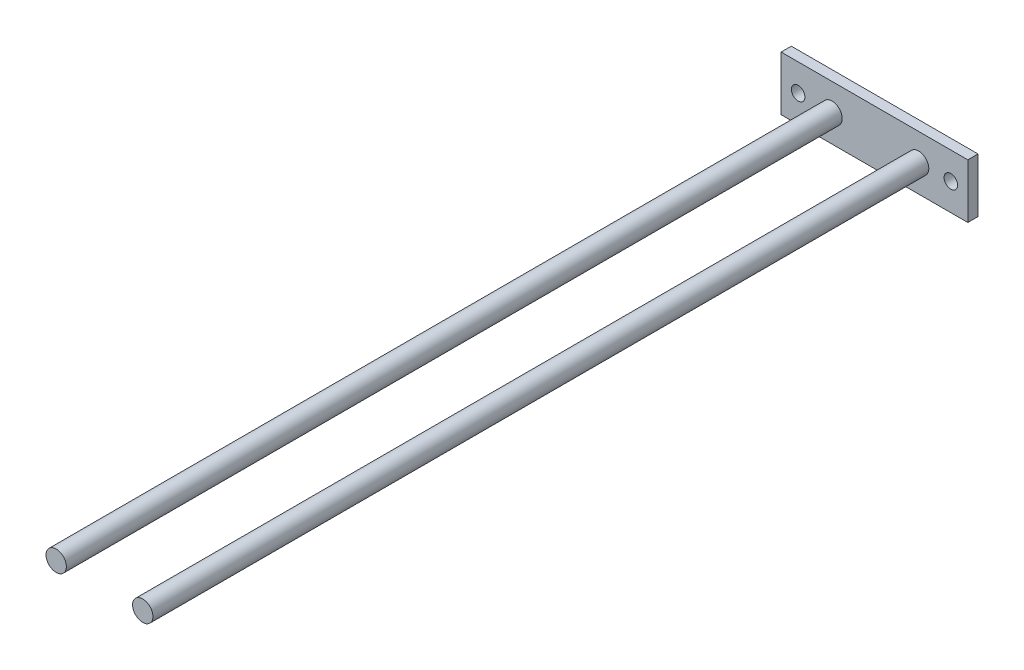
ISO-10303-21;
HEADER;
FILE_DESCRIPTION(('STEP AP214'),'2;1');
FILE_NAME('part.step','',(''),(''),'','','');
FILE_SCHEMA(('AUTOMOTIVE_DESIGN { 1 0 10303 214 1 1 1 1 }'));
ENDSEC;
DATA;
#1=APPLICATION_CONTEXT('core data for automotive mechanical design processes');
#2=APPLICATION_PROTOCOL_DEFINITION('international standard','automotive_design',2000,#1);
#3=PRODUCT_CONTEXT('',#1,'mechanical');
#4=PRODUCT('Part','Part','',(#3));
#5=PRODUCT_RELATED_PRODUCT_CATEGORY('part','',(#4));
#6=PRODUCT_DEFINITION_FORMATION('','',#4);
#7=PRODUCT_DEFINITION_CONTEXT('part definition',#1,'design');
#8=PRODUCT_DEFINITION('design','',#6,#7);
#9=PRODUCT_DEFINITION_SHAPE('','',#8);
#10=(LENGTH_UNIT() NAMED_UNIT(*) SI_UNIT(.MILLI.,.METRE.));
#11=(NAMED_UNIT(*) PLANE_ANGLE_UNIT() SI_UNIT($,.RADIAN.));
#12=(NAMED_UNIT(*) SI_UNIT($,.STERADIAN.) SOLID_ANGLE_UNIT());
#13=UNCERTAINTY_MEASURE_WITH_UNIT(LENGTH_MEASURE(1.E-05),#10,'distance_accuracy_value','');
#14=(GEOMETRIC_REPRESENTATION_CONTEXT(3) GLOBAL_UNCERTAINTY_ASSIGNED_CONTEXT((#13)) GLOBAL_UNIT_ASSIGNED_CONTEXT((#10,
#11,#12)) REPRESENTATION_CONTEXT('',''));
#15=CARTESIAN_POINT('',(0.,0.,0.));
#16=DIRECTION('',(0.,0.,1.));
#17=DIRECTION('',(1.,0.,0.));
#18=AXIS2_PLACEMENT_3D('',#15,#16,#17);
#19=CARTESIAN_POINT('',(0.,0.,3.));
#20=DIRECTION('',(0.,0.,-1.));
#21=DIRECTION('',(-1.,0.,0.));
#22=AXIS2_PLACEMENT_3D('',#19,#20,#21);
#23=PLANE('',#22);
#24=CARTESIAN_POINT('',(13.,0.,3.));
#25=DIRECTION('',(0.,0.,-1.));
#26=DIRECTION('',(-1.,0.,0.));
#27=AXIS2_PLACEMENT_3D('',#24,#25,#26);
#28=CIRCLE('',#27,3.);
#29=CARTESIAN_POINT('',(10.,0.,3.));
#30=VERTEX_POINT('',#29);
#31=EDGE_CURVE('E12',#30,#30,#28,.F.);
#32=ORIENTED_EDGE('',*,*,#31,.F.);
#33=EDGE_LOOP('',(#32));
#34=FACE_BOUND('',#33,.T.);
#35=CARTESIAN_POINT('',(-12.5,0.,3.));
#36=DIRECTION('',(0.,0.,-1.));
#37=DIRECTION('',(-1.,0.,0.));
#38=AXIS2_PLACEMENT_3D('',#35,#36,#37);
#39=CIRCLE('',#38,3.);
#40=CARTESIAN_POINT('',(-15.5,0.,3.));
#41=VERTEX_POINT('',#40);
#42=EDGE_CURVE('E79',#41,#41,#39,.F.);
#43=ORIENTED_EDGE('',*,*,#42,.F.);
#44=EDGE_LOOP('',(#43));
#45=FACE_BOUND('',#44,.T.);
#46=DIRECTION('',(-1.,0.,0.));
#47=VECTOR('',#46,1.);
#48=CARTESIAN_POINT('',(27.5,8.,3.));
#49=LINE('',#48,#47);
#50=CARTESIAN_POINT('',(27.5,8.,3.));
#51=VERTEX_POINT('',#50);
#52=CARTESIAN_POINT('',(-27.5,7.99999999999999,3.));
#53=VERTEX_POINT('',#52);
#54=EDGE_CURVE('E111',#51,#53,#49,.T.);
#55=ORIENTED_EDGE('',*,*,#54,.T.);
#56=DIRECTION('',(0.,1.,0.));
#57=VECTOR('',#56,1.);
#58=CARTESIAN_POINT('',(-27.5,-8.00000000000001,3.));
#59=LINE('',#58,#57);
#60=CARTESIAN_POINT('',(-27.5,-8.00000000000001,3.));
#61=VERTEX_POINT('',#60);
#62=EDGE_CURVE('E119',#61,#53,#59,.T.);
#63=ORIENTED_EDGE('',*,*,#62,.F.);
#64=DIRECTION('',(-1.,0.,0.));
#65=VECTOR('',#64,1.);
#66=CARTESIAN_POINT('',(27.5,-8.,3.));
#67=LINE('',#66,#65);
#68=CARTESIAN_POINT('',(27.5,-8.,3.));
#69=VERTEX_POINT('',#68);
#70=EDGE_CURVE('E130',#69,#61,#67,.T.);
#71=ORIENTED_EDGE('',*,*,#70,.F.);
#72=DIRECTION('',(0.,1.,0.));
#73=VECTOR('',#72,1.);
#74=CARTESIAN_POINT('',(27.5,-8.,3.));
#75=LINE('',#74,#73);
#76=EDGE_CURVE('E87',#69,#51,#75,.T.);
#77=ORIENTED_EDGE('',*,*,#76,.T.);
#78=EDGE_LOOP('',(#55,#63,#71,#77));
#79=FACE_BOUND('',#78,.T.);
#80=CARTESIAN_POINT('',(22.5,0.,3.));
#81=DIRECTION('',(0.,0.,1.));
#82=DIRECTION('',(1.,0.,0.));
#83=AXIS2_PLACEMENT_3D('',#80,#81,#82);
#84=CIRCLE('',#83,2.);
#85=CARTESIAN_POINT('',(24.5,0.,3.));
#86=VERTEX_POINT('',#85);
#87=EDGE_CURVE('E145',#86,#86,#84,.T.);
#88=ORIENTED_EDGE('',*,*,#87,.F.);
#89=EDGE_LOOP('',(#88));
#90=FACE_BOUND('',#89,.T.);
#91=CARTESIAN_POINT('',(-22.5,0.,3.));
#92=DIRECTION('',(0.,0.,1.));
#93=DIRECTION('',(1.,0.,0.));
#94=AXIS2_PLACEMENT_3D('',#91,#92,#93);
#95=CIRCLE('',#94,2.);
#96=CARTESIAN_POINT('',(-20.5,0.,3.));
#97=VERTEX_POINT('',#96);
#98=EDGE_CURVE('E197',#97,#97,#95,.T.);
#99=ORIENTED_EDGE('',*,*,#98,.F.);
#100=EDGE_LOOP('',(#99));
#101=FACE_BOUND('',#100,.T.);
#102=ADVANCED_FACE('F69',(#34,#45,#79,#90,#101),#23,.F.);
#103=CARTESIAN_POINT('',(0.,0.,0.));
#104=DIRECTION('',(0.,0.,-1.));
#105=DIRECTION('',(-1.,0.,0.));
#106=AXIS2_PLACEMENT_3D('',#103,#104,#105);
#107=PLANE('',#106);
#108=CARTESIAN_POINT('',(22.5,0.,0.));
#109=DIRECTION('',(0.,0.,1.));
#110=DIRECTION('',(1.,0.,0.));
#111=AXIS2_PLACEMENT_3D('',#108,#109,#110);
#112=CIRCLE('',#111,2.);
#113=CARTESIAN_POINT('',(24.5,0.,0.));
#114=VERTEX_POINT('',#113);
#115=EDGE_CURVE('E203',#114,#114,#112,.T.);
#116=ORIENTED_EDGE('',*,*,#115,.T.);
#117=EDGE_LOOP('',(#116));
#118=FACE_BOUND('',#117,.T.);
#119=DIRECTION('',(-1.,0.,0.));
#120=VECTOR('',#119,1.);
#121=CARTESIAN_POINT('',(27.5,8.,0.));
#122=LINE('',#121,#120);
#123=CARTESIAN_POINT('',(27.5,8.,0.));
#124=VERTEX_POINT('',#123);
#125=CARTESIAN_POINT('',(-27.5,7.99999999999999,0.));
#126=VERTEX_POINT('',#125);
#127=EDGE_CURVE('E141',#124,#126,#122,.T.);
#128=ORIENTED_EDGE('',*,*,#127,.F.);
#129=DIRECTION('',(0.,1.,0.));
#130=VECTOR('',#129,1.);
#131=CARTESIAN_POINT('',(27.5,-8.,0.));
#132=LINE('',#131,#130);
#133=CARTESIAN_POINT('',(27.5,-8.,0.));
#134=VERTEX_POINT('',#133);
#135=EDGE_CURVE('E106',#134,#124,#132,.T.);
#136=ORIENTED_EDGE('',*,*,#135,.F.);
#137=DIRECTION('',(-1.,0.,0.));
#138=VECTOR('',#137,1.);
#139=CARTESIAN_POINT('',(27.5,-8.,0.));
#140=LINE('',#139,#138);
#141=CARTESIAN_POINT('',(-27.5,-8.00000000000001,0.));
#142=VERTEX_POINT('',#141);
#143=EDGE_CURVE('E148',#134,#142,#140,.T.);
#144=ORIENTED_EDGE('',*,*,#143,.T.);
#145=DIRECTION('',(0.,1.,0.));
#146=VECTOR('',#145,1.);
#147=CARTESIAN_POINT('',(-27.5,-8.00000000000001,0.));
#148=LINE('',#147,#146);
#149=EDGE_CURVE('E121',#142,#126,#148,.T.);
#150=ORIENTED_EDGE('',*,*,#149,.T.);
#151=EDGE_LOOP('',(#128,#136,#144,#150));
#152=FACE_BOUND('',#151,.T.);
#153=CARTESIAN_POINT('',(-22.5,0.,0.));
#154=DIRECTION('',(0.,0.,1.));
#155=DIRECTION('',(1.,0.,0.));
#156=AXIS2_PLACEMENT_3D('',#153,#154,#155);
#157=CIRCLE('',#156,2.);
#158=CARTESIAN_POINT('',(-20.5,0.,0.));
#159=VERTEX_POINT('',#158);
#160=EDGE_CURVE('E194',#159,#159,#157,.T.);
#161=ORIENTED_EDGE('',*,*,#160,.T.);
#162=EDGE_LOOP('',(#161));
#163=FACE_BOUND('',#162,.T.);
#164=ADVANCED_FACE('F165',(#118,#152,#163),#107,.T.);
#165=CARTESIAN_POINT('',(27.5,8.,3.));
#166=DIRECTION('',(0.,-1.,0.));
#167=DIRECTION('',(1.,0.,0.));
#168=AXIS2_PLACEMENT_3D('',#165,#166,#167);
#169=PLANE('',#168);
#170=ORIENTED_EDGE('',*,*,#127,.T.);
#171=DIRECTION('',(0.,0.,-1.));
#172=VECTOR('',#171,1.);
#173=CARTESIAN_POINT('',(-27.5,7.99999999999999,3.));
#174=LINE('',#173,#172);
#175=EDGE_CURVE('E127',#53,#126,#174,.T.);
#176=ORIENTED_EDGE('',*,*,#175,.F.);
#177=ORIENTED_EDGE('',*,*,#54,.F.);
#178=DIRECTION('',(0.,0.,-1.));
#179=VECTOR('',#178,1.);
#180=CARTESIAN_POINT('',(27.5,8.,3.));
#181=LINE('',#180,#179);
#182=EDGE_CURVE('E137',#51,#124,#181,.T.);
#183=ORIENTED_EDGE('',*,*,#182,.T.);
#184=EDGE_LOOP('',(#170,#176,#177,#183));
#185=FACE_BOUND('',#184,.T.);
#186=ADVANCED_FACE('F71',(#185),#169,.F.);
#187=CARTESIAN_POINT('',(-27.5,-8.00000000000001,3.));
#188=DIRECTION('',(-1.,0.,0.));
#189=DIRECTION('',(0.,0.,1.));
#190=AXIS2_PLACEMENT_3D('',#187,#188,#189);
#191=PLANE('',#190);
#192=ORIENTED_EDGE('',*,*,#149,.F.);
#193=DIRECTION('',(0.,0.,-1.));
#194=VECTOR('',#193,1.);
#195=CARTESIAN_POINT('',(-27.5,-8.00000000000001,3.));
#196=LINE('',#195,#194);
#197=EDGE_CURVE('E117',#61,#142,#196,.T.);
#198=ORIENTED_EDGE('',*,*,#197,.F.);
#199=ORIENTED_EDGE('',*,*,#62,.T.);
#200=ORIENTED_EDGE('',*,*,#175,.T.);
#201=EDGE_LOOP('',(#192,#198,#199,#200));
#202=FACE_BOUND('',#201,.T.);
#203=ADVANCED_FACE('F118',(#202),#191,.T.);
#204=CARTESIAN_POINT('',(27.5,-8.,3.));
#205=DIRECTION('',(0.,-1.,0.));
#206=DIRECTION('',(1.,0.,0.));
#207=AXIS2_PLACEMENT_3D('',#204,#205,#206);
#208=PLANE('',#207);
#209=ORIENTED_EDGE('',*,*,#143,.F.);
#210=DIRECTION('',(0.,0.,-1.));
#211=VECTOR('',#210,1.);
#212=CARTESIAN_POINT('',(27.5,-8.,3.));
#213=LINE('',#212,#211);
#214=EDGE_CURVE('E103',#69,#134,#213,.T.);
#215=ORIENTED_EDGE('',*,*,#214,.F.);
#216=ORIENTED_EDGE('',*,*,#70,.T.);
#217=ORIENTED_EDGE('',*,*,#197,.T.);
#218=EDGE_LOOP('',(#209,#215,#216,#217));
#219=FACE_BOUND('',#218,.T.);
#220=ADVANCED_FACE('F133',(#219),#208,.T.);
#221=CARTESIAN_POINT('',(27.5,-8.,3.));
#222=DIRECTION('',(-1.,0.,0.));
#223=DIRECTION('',(0.,0.,1.));
#224=AXIS2_PLACEMENT_3D('',#221,#222,#223);
#225=PLANE('',#224);
#226=ORIENTED_EDGE('',*,*,#135,.T.);
#227=ORIENTED_EDGE('',*,*,#182,.F.);
#228=ORIENTED_EDGE('',*,*,#76,.F.);
#229=ORIENTED_EDGE('',*,*,#214,.T.);
#230=EDGE_LOOP('',(#226,#227,#228,#229));
#231=FACE_BOUND('',#230,.T.);
#232=ADVANCED_FACE('F178',(#231),#225,.F.);
#233=CARTESIAN_POINT('',(22.5,0.,3.));
#234=DIRECTION('',(0.,0.,-1.));
#235=DIRECTION('',(-1.,0.,0.));
#236=AXIS2_PLACEMENT_3D('',#233,#234,#235);
#237=CYLINDRICAL_SURFACE('',#236,2.);
#238=ORIENTED_EDGE('',*,*,#87,.T.);
#239=EDGE_LOOP('',(#238));
#240=FACE_BOUND('',#239,.T.);
#241=ORIENTED_EDGE('',*,*,#115,.F.);
#242=EDGE_LOOP('',(#241));
#243=FACE_BOUND('',#242,.T.);
#244=ADVANCED_FACE('F175',(#240,#243),#237,.F.);
#245=CARTESIAN_POINT('',(-22.5,0.,3.));
#246=DIRECTION('',(0.,0.,-1.));
#247=DIRECTION('',(-1.,0.,0.));
#248=AXIS2_PLACEMENT_3D('',#245,#246,#247);
#249=CYLINDRICAL_SURFACE('',#248,2.);
#250=ORIENTED_EDGE('',*,*,#98,.T.);
#251=EDGE_LOOP('',(#250));
#252=FACE_BOUND('',#251,.T.);
#253=ORIENTED_EDGE('',*,*,#160,.F.);
#254=EDGE_LOOP('',(#253));
#255=FACE_BOUND('',#254,.T.);
#256=ADVANCED_FACE('F218',(#252,#255),#249,.F.);
#257=CARTESIAN_POINT('',(-12.5,0.,231.6));
#258=DIRECTION('',(0.,0.,-1.));
#259=DIRECTION('',(-1.,0.,0.));
#260=AXIS2_PLACEMENT_3D('',#257,#258,#259);
#261=CYLINDRICAL_SURFACE('',#260,3.);
#262=CARTESIAN_POINT('',(-12.5,0.,231.6));
#263=DIRECTION('',(0.,0.,1.));
#264=DIRECTION('',(1.,0.,0.));
#265=AXIS2_PLACEMENT_3D('',#262,#263,#264);
#266=CIRCLE('',#265,3.);
#267=CARTESIAN_POINT('',(-9.50000000000001,0.,231.6));
#268=VERTEX_POINT('',#267);
#269=EDGE_CURVE('E198',#268,#268,#266,.T.);
#270=ORIENTED_EDGE('',*,*,#269,.F.);
#271=EDGE_LOOP('',(#270));
#272=FACE_BOUND('',#271,.T.);
#273=ORIENTED_EDGE('',*,*,#42,.T.);
#274=EDGE_LOOP('',(#273));
#275=FACE_BOUND('',#274,.T.);
#276=ADVANCED_FACE('F162',(#272,#275),#261,.T.);
#277=CARTESIAN_POINT('',(-12.5,0.,231.6));
#278=DIRECTION('',(0.,0.,1.));
#279=DIRECTION('',(1.,0.,0.));
#280=AXIS2_PLACEMENT_3D('',#277,#278,#279);
#281=PLANE('',#280);
#282=ORIENTED_EDGE('',*,*,#269,.T.);
#283=EDGE_LOOP('',(#282));
#284=FACE_BOUND('',#283,.T.);
#285=ADVANCED_FACE('F230',(#284),#281,.T.);
#286=CARTESIAN_POINT('',(13.,0.,231.6));
#287=DIRECTION('',(0.,0.,-1.));
#288=DIRECTION('',(-1.,0.,0.));
#289=AXIS2_PLACEMENT_3D('',#286,#287,#288);
#290=CYLINDRICAL_SURFACE('',#289,3.);
#291=CARTESIAN_POINT('',(13.,0.,231.6));
#292=DIRECTION('',(0.,0.,1.));
#293=DIRECTION('',(1.,0.,0.));
#294=AXIS2_PLACEMENT_3D('',#291,#292,#293);
#295=CIRCLE('',#294,3.);
#296=CARTESIAN_POINT('',(16.,0.,231.6));
#297=VERTEX_POINT('',#296);
#298=EDGE_CURVE('E206',#297,#297,#295,.T.);
#299=ORIENTED_EDGE('',*,*,#298,.F.);
#300=EDGE_LOOP('',(#299));
#301=FACE_BOUND('',#300,.T.);
#302=ORIENTED_EDGE('',*,*,#31,.T.);
#303=EDGE_LOOP('',(#302));
#304=FACE_BOUND('',#303,.T.);
#305=ADVANCED_FACE('F236',(#301,#304),#290,.T.);
#306=CARTESIAN_POINT('',(13.,0.,231.6));
#307=DIRECTION('',(0.,0.,1.));
#308=DIRECTION('',(1.,0.,0.));
#309=AXIS2_PLACEMENT_3D('',#306,#307,#308);
#310=PLANE('',#309);
#311=ORIENTED_EDGE('',*,*,#298,.T.);
#312=EDGE_LOOP('',(#311));
#313=FACE_BOUND('',#312,.T.);
#314=ADVANCED_FACE('F240',(#313),#310,.T.);
#315=CLOSED_SHELL('',(#102,#164,#186,#203,#220,#232,#244,#256,#276,#285,#305,#314));
#316=MANIFOLD_SOLID_BREP('B2',#315);
#317=ADVANCED_BREP_SHAPE_REPRESENTATION('',(#18,#316),#14);
#318=SHAPE_DEFINITION_REPRESENTATION(#9,#317);
ENDSEC;
END-ISO-10303-21;
